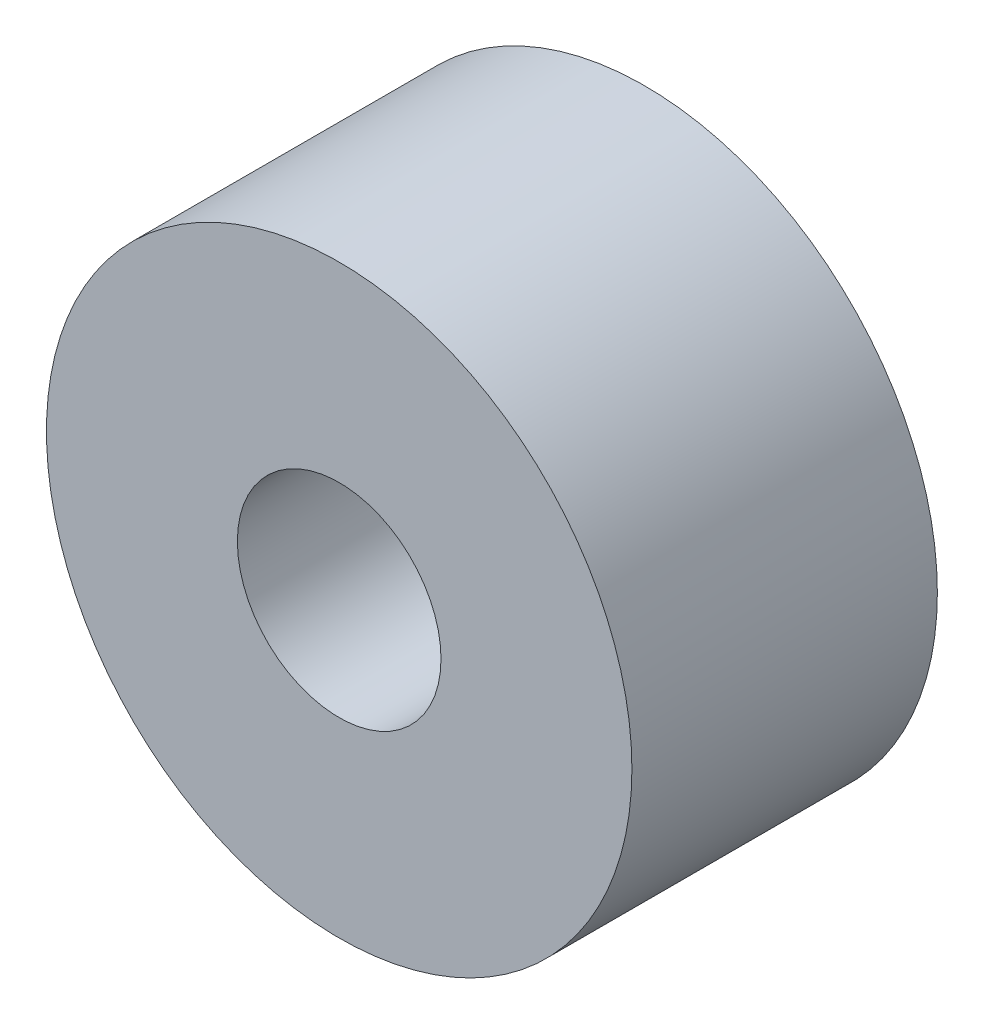
ISO-10303-21;
HEADER;
FILE_DESCRIPTION(('STEP AP214'),'2;1');
FILE_NAME('part.step','',(''),(''),'','','');
FILE_SCHEMA(('AUTOMOTIVE_DESIGN { 1 0 10303 214 1 1 1 1 }'));
ENDSEC;
DATA;
#1=APPLICATION_CONTEXT('core data for automotive mechanical design processes');
#2=APPLICATION_PROTOCOL_DEFINITION('international standard','automotive_design',2000,#1);
#3=PRODUCT_CONTEXT('',#1,'mechanical');
#4=PRODUCT('Part','Part','',(#3));
#5=PRODUCT_RELATED_PRODUCT_CATEGORY('part','',(#4));
#6=PRODUCT_DEFINITION_FORMATION('','',#4);
#7=PRODUCT_DEFINITION_CONTEXT('part definition',#1,'design');
#8=PRODUCT_DEFINITION('design','',#6,#7);
#9=PRODUCT_DEFINITION_SHAPE('','',#8);
#10=(LENGTH_UNIT() NAMED_UNIT(*) SI_UNIT(.MILLI.,.METRE.));
#11=(NAMED_UNIT(*) PLANE_ANGLE_UNIT() SI_UNIT($,.RADIAN.));
#12=(NAMED_UNIT(*) SI_UNIT($,.STERADIAN.) SOLID_ANGLE_UNIT());
#13=UNCERTAINTY_MEASURE_WITH_UNIT(LENGTH_MEASURE(1.E-05),#10,'distance_accuracy_value','');
#14=(GEOMETRIC_REPRESENTATION_CONTEXT(3) GLOBAL_UNCERTAINTY_ASSIGNED_CONTEXT((#13)) GLOBAL_UNIT_ASSIGNED_CONTEXT((#10,
#11,#12)) REPRESENTATION_CONTEXT('',''));
#15=CARTESIAN_POINT('',(0.,0.,0.));
#16=DIRECTION('',(0.,0.,1.));
#17=DIRECTION('',(1.,0.,0.));
#18=AXIS2_PLACEMENT_3D('',#15,#16,#17);
#19=CARTESIAN_POINT('',(0.,0.,31.76684231039));
#20=DIRECTION('',(0.,0.,1.));
#21=DIRECTION('',(1.,0.,0.));
#22=AXIS2_PLACEMENT_3D('',#19,#20,#21);
#23=PLANE('',#22);
#24=CARTESIAN_POINT('',(0.,0.,31.76684231039));
#25=DIRECTION('',(0.,0.,1.));
#26=DIRECTION('',(1.,0.,0.));
#27=AXIS2_PLACEMENT_3D('',#24,#25,#26);
#28=CIRCLE('',#27,5.75);
#29=CARTESIAN_POINT('',(5.75,0.,31.76684231039));
#30=VERTEX_POINT('',#29);
#31=EDGE_CURVE('E10',#30,#30,#28,.T.);
#32=ORIENTED_EDGE('',*,*,#31,.T.);
#33=EDGE_LOOP('',(#32));
#34=FACE_BOUND('',#33,.T.);
#35=CARTESIAN_POINT('',(0.,0.,31.76684231039));
#36=DIRECTION('',(0.,0.,1.));
#37=DIRECTION('',(1.,0.,0.));
#38=AXIS2_PLACEMENT_3D('',#35,#36,#37);
#39=CIRCLE('',#38,2.);
#40=CARTESIAN_POINT('',(2.,0.,31.76684231039));
#41=VERTEX_POINT('',#40);
#42=EDGE_CURVE('E39',#41,#41,#39,.T.);
#43=ORIENTED_EDGE('',*,*,#42,.F.);
#44=EDGE_LOOP('',(#43));
#45=FACE_BOUND('',#44,.T.);
#46=ADVANCED_FACE('F28',(#34,#45),#23,.T.);
#47=CARTESIAN_POINT('',(0.,0.,25.76684231039));
#48=DIRECTION('',(0.,0.,1.));
#49=DIRECTION('',(1.,0.,0.));
#50=AXIS2_PLACEMENT_3D('',#47,#48,#49);
#51=PLANE('',#50);
#52=CARTESIAN_POINT('',(0.,0.,25.76684231039));
#53=DIRECTION('',(0.,0.,1.));
#54=DIRECTION('',(1.,0.,0.));
#55=AXIS2_PLACEMENT_3D('',#52,#53,#54);
#56=CIRCLE('',#55,5.75);
#57=CARTESIAN_POINT('',(5.75,0.,25.76684231039));
#58=VERTEX_POINT('',#57);
#59=EDGE_CURVE('E32',#58,#58,#56,.T.);
#60=ORIENTED_EDGE('',*,*,#59,.F.);
#61=EDGE_LOOP('',(#60));
#62=FACE_BOUND('',#61,.T.);
#63=CARTESIAN_POINT('',(0.,0.,25.76684231039));
#64=DIRECTION('',(0.,0.,1.));
#65=DIRECTION('',(1.,0.,0.));
#66=AXIS2_PLACEMENT_3D('',#63,#64,#65);
#67=CIRCLE('',#66,2.);
#68=CARTESIAN_POINT('',(2.,0.,25.76684231039));
#69=VERTEX_POINT('',#68);
#70=EDGE_CURVE('E41',#69,#69,#67,.T.);
#71=ORIENTED_EDGE('',*,*,#70,.T.);
#72=EDGE_LOOP('',(#71));
#73=FACE_BOUND('',#72,.T.);
#74=ADVANCED_FACE('F51',(#62,#73),#51,.F.);
#75=CARTESIAN_POINT('',(0.,0.,31.76684231039));
#76=DIRECTION('',(0.,0.,-1.));
#77=DIRECTION('',(-1.,0.,0.));
#78=AXIS2_PLACEMENT_3D('',#75,#76,#77);
#79=CYLINDRICAL_SURFACE('',#78,5.75);
#80=ORIENTED_EDGE('',*,*,#31,.F.);
#81=EDGE_LOOP('',(#80));
#82=FACE_BOUND('',#81,.T.);
#83=ORIENTED_EDGE('',*,*,#59,.T.);
#84=EDGE_LOOP('',(#83));
#85=FACE_BOUND('',#84,.T.);
#86=ADVANCED_FACE('F30',(#82,#85),#79,.T.);
#87=CARTESIAN_POINT('',(0.,0.,31.76684231039));
#88=DIRECTION('',(0.,0.,-1.));
#89=DIRECTION('',(-1.,0.,0.));
#90=AXIS2_PLACEMENT_3D('',#87,#88,#89);
#91=CYLINDRICAL_SURFACE('',#90,2.);
#92=ORIENTED_EDGE('',*,*,#42,.T.);
#93=EDGE_LOOP('',(#92));
#94=FACE_BOUND('',#93,.T.);
#95=ORIENTED_EDGE('',*,*,#70,.F.);
#96=EDGE_LOOP('',(#95));
#97=FACE_BOUND('',#96,.T.);
#98=ADVANCED_FACE('F47',(#94,#97),#91,.F.);
#99=CLOSED_SHELL('',(#46,#74,#86,#98));
#100=MANIFOLD_SOLID_BREP('B2',#99);
#101=ADVANCED_BREP_SHAPE_REPRESENTATION('',(#18,#100),#14);
#102=SHAPE_DEFINITION_REPRESENTATION(#9,#101);
ENDSEC;
END-ISO-10303-21;
